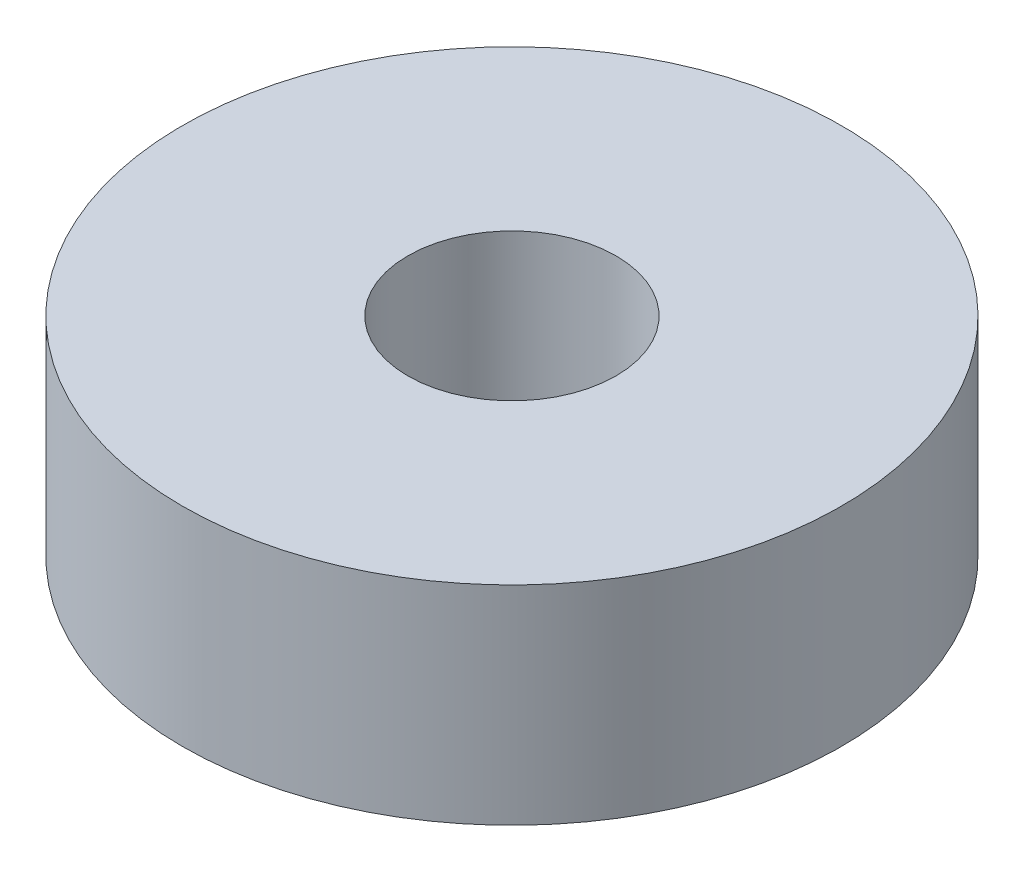
ISO-10303-21;
HEADER;
FILE_DESCRIPTION(('STEP AP214'),'2;1');
FILE_NAME('part.step','',(''),(''),'','','');
FILE_SCHEMA(('AUTOMOTIVE_DESIGN { 1 0 10303 214 1 1 1 1 }'));
ENDSEC;
DATA;
#1=APPLICATION_CONTEXT('core data for automotive mechanical design processes');
#2=APPLICATION_PROTOCOL_DEFINITION('international standard','automotive_design',2000,#1);
#3=PRODUCT_CONTEXT('',#1,'mechanical');
#4=PRODUCT('Part','Part','',(#3));
#5=PRODUCT_RELATED_PRODUCT_CATEGORY('part','',(#4));
#6=PRODUCT_DEFINITION_FORMATION('','',#4);
#7=PRODUCT_DEFINITION_CONTEXT('part definition',#1,'design');
#8=PRODUCT_DEFINITION('design','',#6,#7);
#9=PRODUCT_DEFINITION_SHAPE('','',#8);
#10=(LENGTH_UNIT() NAMED_UNIT(*) SI_UNIT(.MILLI.,.METRE.));
#11=(NAMED_UNIT(*) PLANE_ANGLE_UNIT() SI_UNIT($,.RADIAN.));
#12=(NAMED_UNIT(*) SI_UNIT($,.STERADIAN.) SOLID_ANGLE_UNIT());
#13=UNCERTAINTY_MEASURE_WITH_UNIT(LENGTH_MEASURE(1.E-05),#10,'distance_accuracy_value','');
#14=(GEOMETRIC_REPRESENTATION_CONTEXT(3) GLOBAL_UNCERTAINTY_ASSIGNED_CONTEXT((#13)) GLOBAL_UNIT_ASSIGNED_CONTEXT((#10,
#11,#12)) REPRESENTATION_CONTEXT('',''));
#15=CARTESIAN_POINT('',(0.,0.,0.));
#16=DIRECTION('',(0.,0.,1.));
#17=DIRECTION('',(1.,0.,0.));
#18=AXIS2_PLACEMENT_3D('',#15,#16,#17);
#19=CARTESIAN_POINT('',(0.,6.,0.));
#20=DIRECTION('',(0.,1.,0.));
#21=DIRECTION('',(0.,0.,1.));
#22=AXIS2_PLACEMENT_3D('',#19,#20,#21);
#23=PLANE('',#22);
#24=CARTESIAN_POINT('',(0.,6.,0.));
#25=DIRECTION('',(0.,1.,0.));
#26=DIRECTION('',(0.,0.,1.));
#27=AXIS2_PLACEMENT_3D('',#24,#25,#26);
#28=CIRCLE('',#27,9.5);
#29=CARTESIAN_POINT('',(0.,6.,9.5));
#30=VERTEX_POINT('',#29);
#31=EDGE_CURVE('E10',#30,#30,#28,.T.);
#32=ORIENTED_EDGE('',*,*,#31,.T.);
#33=EDGE_LOOP('',(#32));
#34=FACE_BOUND('',#33,.T.);
#35=CARTESIAN_POINT('',(0.,6.,0.));
#36=DIRECTION('',(0.,1.,0.));
#37=DIRECTION('',(0.,0.,1.));
#38=AXIS2_PLACEMENT_3D('',#35,#36,#37);
#39=CIRCLE('',#38,3.);
#40=CARTESIAN_POINT('',(0.,6.,3.));
#41=VERTEX_POINT('',#40);
#42=EDGE_CURVE('E52',#41,#41,#39,.T.);
#43=ORIENTED_EDGE('',*,*,#42,.F.);
#44=EDGE_LOOP('',(#43));
#45=FACE_BOUND('',#44,.T.);
#46=ADVANCED_FACE('F39',(#34,#45),#23,.T.);
#47=CARTESIAN_POINT('',(0.,0.,0.));
#48=DIRECTION('',(0.,1.,0.));
#49=DIRECTION('',(0.,0.,1.));
#50=AXIS2_PLACEMENT_3D('',#47,#48,#49);
#51=PLANE('',#50);
#52=CARTESIAN_POINT('',(0.,0.,0.));
#53=DIRECTION('',(0.,1.,0.));
#54=DIRECTION('',(0.,0.,1.));
#55=AXIS2_PLACEMENT_3D('',#52,#53,#54);
#56=CIRCLE('',#55,9.5);
#57=CARTESIAN_POINT('',(0.,0.,9.5));
#58=VERTEX_POINT('',#57);
#59=EDGE_CURVE('E43',#58,#58,#56,.T.);
#60=ORIENTED_EDGE('',*,*,#59,.F.);
#61=EDGE_LOOP('',(#60));
#62=FACE_BOUND('',#61,.T.);
#63=CARTESIAN_POINT('',(0.,0.,0.));
#64=DIRECTION('',(0.,1.,0.));
#65=DIRECTION('',(0.,0.,1.));
#66=AXIS2_PLACEMENT_3D('',#63,#64,#65);
#67=CIRCLE('',#66,3.);
#68=CARTESIAN_POINT('',(0.,0.,3.));
#69=VERTEX_POINT('',#68);
#70=EDGE_CURVE('E54',#69,#69,#67,.T.);
#71=ORIENTED_EDGE('',*,*,#70,.T.);
#72=EDGE_LOOP('',(#71));
#73=FACE_BOUND('',#72,.T.);
#74=ADVANCED_FACE('F66',(#62,#73),#51,.F.);
#75=CARTESIAN_POINT('',(0.,6.,0.));
#76=DIRECTION('',(0.,-1.,0.));
#77=DIRECTION('',(0.,0.,-1.));
#78=AXIS2_PLACEMENT_3D('',#75,#76,#77);
#79=CYLINDRICAL_SURFACE('',#78,9.5);
#80=ORIENTED_EDGE('',*,*,#31,.F.);
#81=EDGE_LOOP('',(#80));
#82=FACE_BOUND('',#81,.T.);
#83=ORIENTED_EDGE('',*,*,#59,.T.);
#84=EDGE_LOOP('',(#83));
#85=FACE_BOUND('',#84,.T.);
#86=ADVANCED_FACE('F41',(#82,#85),#79,.T.);
#87=CARTESIAN_POINT('',(0.,6.,0.));
#88=DIRECTION('',(0.,-1.,0.));
#89=DIRECTION('',(0.,0.,-1.));
#90=AXIS2_PLACEMENT_3D('',#87,#88,#89);
#91=CYLINDRICAL_SURFACE('',#90,3.);
#92=ORIENTED_EDGE('',*,*,#42,.T.);
#93=EDGE_LOOP('',(#92));
#94=FACE_BOUND('',#93,.T.);
#95=ORIENTED_EDGE('',*,*,#70,.F.);
#96=EDGE_LOOP('',(#95));
#97=FACE_BOUND('',#96,.T.);
#98=ADVANCED_FACE('F62',(#94,#97),#91,.F.);
#99=CLOSED_SHELL('',(#46,#74,#86,#98));
#100=MANIFOLD_SOLID_BREP('B2',#99);
#101=ADVANCED_BREP_SHAPE_REPRESENTATION('',(#18,#100),#14);
#102=SHAPE_DEFINITION_REPRESENTATION(#9,#101);
ENDSEC;
END-ISO-10303-21;
